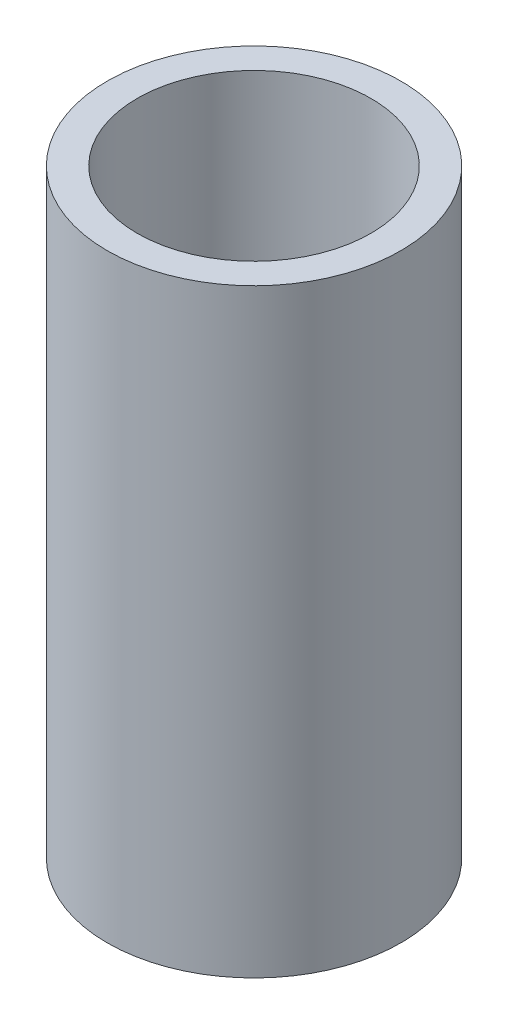
ISO-10303-21;
HEADER;
FILE_DESCRIPTION(('STEP AP214'),'2;1');
FILE_NAME('part.step','',(''),(''),'','','');
FILE_SCHEMA(('AUTOMOTIVE_DESIGN { 1 0 10303 214 1 1 1 1 }'));
ENDSEC;
DATA;
#1=APPLICATION_CONTEXT('core data for automotive mechanical design processes');
#2=APPLICATION_PROTOCOL_DEFINITION('international standard','automotive_design',2000,#1);
#3=PRODUCT_CONTEXT('',#1,'mechanical');
#4=PRODUCT('Part','Part','',(#3));
#5=PRODUCT_RELATED_PRODUCT_CATEGORY('part','',(#4));
#6=PRODUCT_DEFINITION_FORMATION('','',#4);
#7=PRODUCT_DEFINITION_CONTEXT('part definition',#1,'design');
#8=PRODUCT_DEFINITION('design','',#6,#7);
#9=PRODUCT_DEFINITION_SHAPE('','',#8);
#10=(LENGTH_UNIT() NAMED_UNIT(*) SI_UNIT(.MILLI.,.METRE.));
#11=(NAMED_UNIT(*) PLANE_ANGLE_UNIT() SI_UNIT($,.RADIAN.));
#12=(NAMED_UNIT(*) SI_UNIT($,.STERADIAN.) SOLID_ANGLE_UNIT());
#13=UNCERTAINTY_MEASURE_WITH_UNIT(LENGTH_MEASURE(1.E-05),#10,'distance_accuracy_value','');
#14=(GEOMETRIC_REPRESENTATION_CONTEXT(3) GLOBAL_UNCERTAINTY_ASSIGNED_CONTEXT((#13)) GLOBAL_UNIT_ASSIGNED_CONTEXT((#10,
#11,#12)) REPRESENTATION_CONTEXT('',''));
#15=CARTESIAN_POINT('',(0.,0.,0.));
#16=DIRECTION('',(0.,0.,1.));
#17=DIRECTION('',(1.,0.,0.));
#18=AXIS2_PLACEMENT_3D('',#15,#16,#17);
#19=CARTESIAN_POINT('',(0.,10.,0.));
#20=DIRECTION('',(0.,-1.,0.));
#21=DIRECTION('',(0.,0.,-1.));
#22=AXIS2_PLACEMENT_3D('',#19,#20,#21);
#23=CYLINDRICAL_SURFACE('',#22,24.5);
#24=CARTESIAN_POINT('',(0.,0.,0.));
#25=DIRECTION('',(0.,1.,0.));
#26=DIRECTION('',(0.,0.,1.));
#27=AXIS2_PLACEMENT_3D('',#24,#25,#26);
#28=CIRCLE('',#27,24.5);
#29=CARTESIAN_POINT('',(0.,0.,24.5));
#30=VERTEX_POINT('',#29);
#31=EDGE_CURVE('E46',#30,#30,#28,.T.);
#32=ORIENTED_EDGE('',*,*,#31,.T.);
#33=EDGE_LOOP('',(#32));
#34=FACE_BOUND('',#33,.T.);
#35=CARTESIAN_POINT('',(0.,100.,0.));
#36=DIRECTION('',(0.,1.,0.));
#37=DIRECTION('',(0.,0.,1.));
#38=AXIS2_PLACEMENT_3D('',#35,#36,#37);
#39=CIRCLE('',#38,24.5);
#40=CARTESIAN_POINT('',(0.,100.,24.5));
#41=VERTEX_POINT('',#40);
#42=EDGE_CURVE('E51',#41,#41,#39,.T.);
#43=ORIENTED_EDGE('',*,*,#42,.F.);
#44=EDGE_LOOP('',(#43));
#45=FACE_BOUND('',#44,.T.);
#46=ADVANCED_FACE('F39',(#34,#45),#23,.T.);
#47=CARTESIAN_POINT('',(0.,0.,0.));
#48=DIRECTION('',(0.,1.,0.));
#49=DIRECTION('',(0.,0.,1.));
#50=AXIS2_PLACEMENT_3D('',#47,#48,#49);
#51=PLANE('',#50);
#52=ORIENTED_EDGE('',*,*,#31,.F.);
#53=EDGE_LOOP('',(#52));
#54=FACE_BOUND('',#53,.T.);
#55=ADVANCED_FACE('F67',(#54),#51,.F.);
#56=CARTESIAN_POINT('',(0.,100.,0.));
#57=DIRECTION('',(0.,1.,0.));
#58=DIRECTION('',(0.,0.,1.));
#59=AXIS2_PLACEMENT_3D('',#56,#57,#58);
#60=PLANE('',#59);
#61=ORIENTED_EDGE('',*,*,#42,.T.);
#62=EDGE_LOOP('',(#61));
#63=FACE_BOUND('',#62,.T.);
#64=CARTESIAN_POINT('',(0.,100.,0.));
#65=DIRECTION('',(0.,1.,0.));
#66=DIRECTION('',(0.,0.,1.));
#67=AXIS2_PLACEMENT_3D('',#64,#65,#66);
#68=CIRCLE('',#67,19.5);
#69=CARTESIAN_POINT('',(0.,100.,19.5));
#70=VERTEX_POINT('',#69);
#71=EDGE_CURVE('E56',#70,#70,#68,.T.);
#72=ORIENTED_EDGE('',*,*,#71,.F.);
#73=EDGE_LOOP('',(#72));
#74=FACE_BOUND('',#73,.T.);
#75=ADVANCED_FACE('F65',(#63,#74),#60,.T.);
#76=CARTESIAN_POINT('',(0.,100.,0.));
#77=DIRECTION('',(0.,-1.,0.));
#78=DIRECTION('',(0.,0.,-1.));
#79=AXIS2_PLACEMENT_3D('',#76,#77,#78);
#80=CYLINDRICAL_SURFACE('',#79,19.5);
#81=ORIENTED_EDGE('',*,*,#71,.T.);
#82=EDGE_LOOP('',(#81));
#83=FACE_BOUND('',#82,.T.);
#84=CARTESIAN_POINT('',(0.,9.99999999999999,0.));
#85=DIRECTION('',(0.,1.,0.));
#86=DIRECTION('',(0.,0.,1.));
#87=AXIS2_PLACEMENT_3D('',#84,#85,#86);
#88=CIRCLE('',#87,19.5);
#89=CARTESIAN_POINT('',(0.,9.99999999999999,19.5));
#90=VERTEX_POINT('',#89);
#91=EDGE_CURVE('E10',#90,#90,#88,.F.);
#92=ORIENTED_EDGE('',*,*,#91,.T.);
#93=EDGE_LOOP('',(#92));
#94=FACE_BOUND('',#93,.T.);
#95=ADVANCED_FACE('F63',(#83,#94),#80,.F.);
#96=CARTESIAN_POINT('',(0.,10.,0.));
#97=DIRECTION('',(0.,1.,0.));
#98=DIRECTION('',(0.,0.,1.));
#99=AXIS2_PLACEMENT_3D('',#96,#97,#98);
#100=PLANE('',#99);
#101=ORIENTED_EDGE('',*,*,#91,.F.);
#102=EDGE_LOOP('',(#101));
#103=FACE_BOUND('',#102,.T.);
#104=ADVANCED_FACE('F74',(#103),#100,.T.);
#105=CLOSED_SHELL('',(#46,#55,#75,#95,#104));
#106=MANIFOLD_SOLID_BREP('B2',#105);
#107=ADVANCED_BREP_SHAPE_REPRESENTATION('',(#18,#106),#14);
#108=SHAPE_DEFINITION_REPRESENTATION(#9,#107);
ENDSEC;
END-ISO-10303-21;
